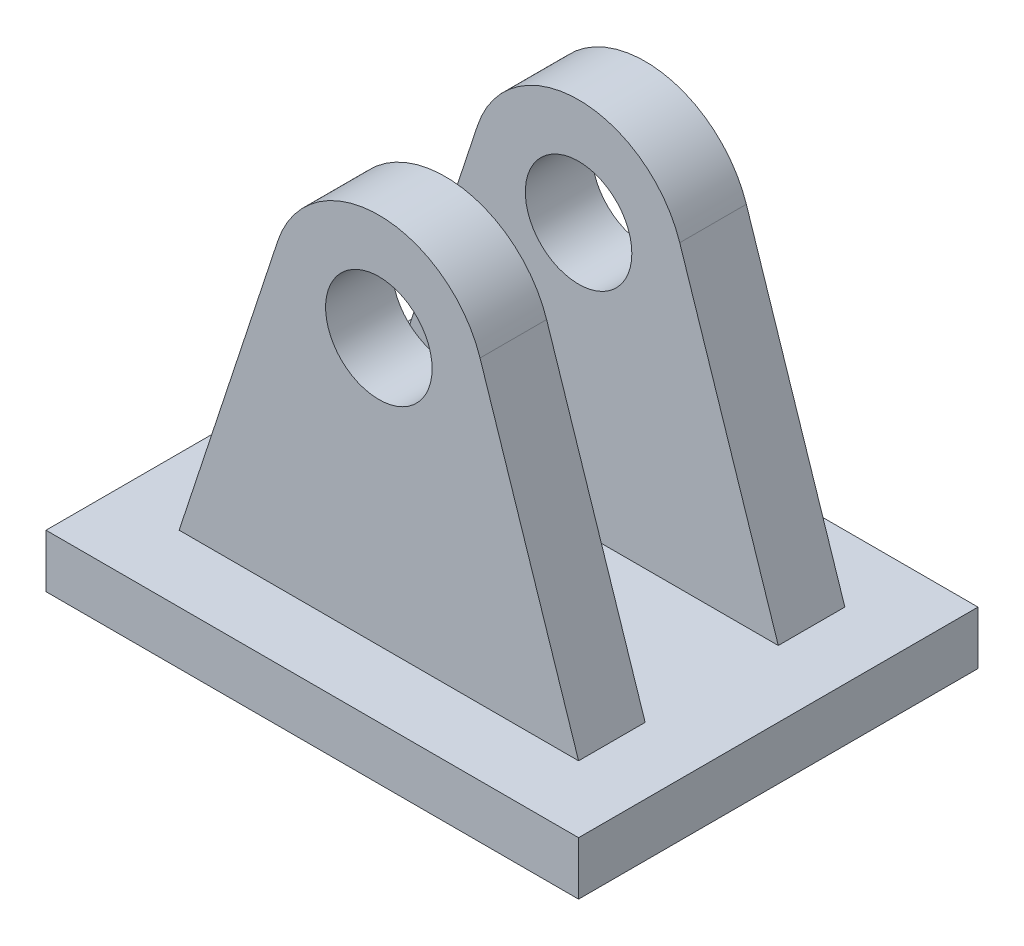
ISO-10303-21;
HEADER;
FILE_DESCRIPTION(('STEP AP214'),'2;1');
FILE_NAME('part.step','',(''),(''),'','','');
FILE_SCHEMA(('AUTOMOTIVE_DESIGN { 1 0 10303 214 1 1 1 1 }'));
ENDSEC;
DATA;
#1=APPLICATION_CONTEXT('core data for automotive mechanical design processes');
#2=APPLICATION_PROTOCOL_DEFINITION('international standard','automotive_design',2000,#1);
#3=PRODUCT_CONTEXT('',#1,'mechanical');
#4=PRODUCT('Part','Part','',(#3));
#5=PRODUCT_RELATED_PRODUCT_CATEGORY('part','',(#4));
#6=PRODUCT_DEFINITION_FORMATION('','',#4);
#7=PRODUCT_DEFINITION_CONTEXT('part definition',#1,'design');
#8=PRODUCT_DEFINITION('design','',#6,#7);
#9=PRODUCT_DEFINITION_SHAPE('','',#8);
#10=(LENGTH_UNIT() NAMED_UNIT(*) SI_UNIT(.MILLI.,.METRE.));
#11=(NAMED_UNIT(*) PLANE_ANGLE_UNIT() SI_UNIT($,.RADIAN.));
#12=(NAMED_UNIT(*) SI_UNIT($,.STERADIAN.) SOLID_ANGLE_UNIT());
#13=UNCERTAINTY_MEASURE_WITH_UNIT(LENGTH_MEASURE(1.E-05),#10,'distance_accuracy_value','');
#14=(GEOMETRIC_REPRESENTATION_CONTEXT(3) GLOBAL_UNCERTAINTY_ASSIGNED_CONTEXT((#13)) GLOBAL_UNIT_ASSIGNED_CONTEXT((#10,
#11,#12)) REPRESENTATION_CONTEXT('',''));
#15=CARTESIAN_POINT('',(0.,0.,0.));
#16=DIRECTION('',(0.,0.,1.));
#17=DIRECTION('',(1.,0.,0.));
#18=AXIS2_PLACEMENT_3D('',#15,#16,#17);
#19=CARTESIAN_POINT('',(0.,120.,50.));
#20=DIRECTION('',(0.,0.,-1.));
#21=DIRECTION('',(-1.,0.,0.));
#22=AXIS2_PLACEMENT_3D('',#19,#20,#21);
#23=CYLINDRICAL_SURFACE('',#22,40.);
#24=CARTESIAN_POINT('',(0.,120.,-25.));
#25=DIRECTION('',(0.,0.,1.));
#26=DIRECTION('',(1.,0.,0.));
#27=AXIS2_PLACEMENT_3D('',#24,#25,#26);
#28=CIRCLE('',#27,40.);
#29=CARTESIAN_POINT('',(37.9973613627572,132.498021022068,-25.));
#30=VERTEX_POINT('',#29);
#31=CARTESIAN_POINT('',(-37.9973613627572,132.498021022068,-25.));
#32=VERTEX_POINT('',#31);
#33=EDGE_CURVE('E129',#30,#32,#28,.T.);
#34=ORIENTED_EDGE('',*,*,#33,.F.);
#35=DIRECTION('',(0.,0.,-1.));
#36=VECTOR('',#35,1.);
#37=CARTESIAN_POINT('',(37.9973613627572,132.498021022068,50.));
#38=LINE('',#37,#36);
#39=CARTESIAN_POINT('',(37.9973613627572,132.498021022068,-50.));
#40=VERTEX_POINT('',#39);
#41=EDGE_CURVE('E239',#30,#40,#38,.T.);
#42=ORIENTED_EDGE('',*,*,#41,.T.);
#43=CARTESIAN_POINT('',(0.,120.,-50.));
#44=DIRECTION('',(0.,0.,1.));
#45=DIRECTION('',(1.,0.,0.));
#46=AXIS2_PLACEMENT_3D('',#43,#44,#45);
#47=CIRCLE('',#46,40.);
#48=CARTESIAN_POINT('',(-37.9973613627572,132.498021022068,-50.));
#49=VERTEX_POINT('',#48);
#50=EDGE_CURVE('E149',#40,#49,#47,.T.);
#51=ORIENTED_EDGE('',*,*,#50,.T.);
#52=DIRECTION('',(0.,0.,-1.));
#53=VECTOR('',#52,1.);
#54=CARTESIAN_POINT('',(-37.9973613627572,132.498021022068,50.));
#55=LINE('',#54,#53);
#56=EDGE_CURVE('E143',#32,#49,#55,.T.);
#57=ORIENTED_EDGE('',*,*,#56,.F.);
#58=EDGE_LOOP('',(#34,#42,#51,#57));
#59=FACE_BOUND('',#58,.T.);
#60=ADVANCED_FACE('F37',(#59),#23,.T.);
#61=CARTESIAN_POINT('',(-37.9973613627572,132.498021022068,50.));
#62=DIRECTION('',(0.949934034068929,-0.312450525551696,0.));
#63=DIRECTION('',(0.312450525551696,0.949934034068929,0.));
#64=AXIS2_PLACEMENT_3D('',#61,#62,#63);
#65=PLANE('',#64);
#66=DIRECTION('',(-0.312450525551696,-0.949934034068929,0.));
#67=VECTOR('',#66,1.);
#68=CARTESIAN_POINT('',(-37.9973613627572,132.498021022068,-25.));
#69=LINE('',#68,#67);
#70=CARTESIAN_POINT('',(-75.,20.,-25.));
#71=VERTEX_POINT('',#70);
#72=EDGE_CURVE('E132',#32,#71,#69,.T.);
#73=ORIENTED_EDGE('',*,*,#72,.F.);
#74=ORIENTED_EDGE('',*,*,#56,.T.);
#75=DIRECTION('',(-0.312450525551696,-0.949934034068929,0.));
#76=VECTOR('',#75,1.);
#77=CARTESIAN_POINT('',(-37.9973613627572,132.498021022068,-50.));
#78=LINE('',#77,#76);
#79=CARTESIAN_POINT('',(-75.,20.,-50.));
#80=VERTEX_POINT('',#79);
#81=EDGE_CURVE('E266',#49,#80,#78,.T.);
#82=ORIENTED_EDGE('',*,*,#81,.T.);
#83=DIRECTION('',(0.,0.,-1.));
#84=VECTOR('',#83,1.);
#85=CARTESIAN_POINT('',(-75.,20.,50.));
#86=LINE('',#85,#84);
#87=EDGE_CURVE('E61',#71,#80,#86,.T.);
#88=ORIENTED_EDGE('',*,*,#87,.F.);
#89=EDGE_LOOP('',(#73,#74,#82,#88));
#90=FACE_BOUND('',#89,.T.);
#91=ADVANCED_FACE('F141',(#90),#65,.F.);
#92=CARTESIAN_POINT('',(37.9973613627572,132.498021022068,50.));
#93=DIRECTION('',(-0.949934034068929,-0.312450525551696,0.));
#94=DIRECTION('',(0.312450525551696,-0.949934034068929,0.));
#95=AXIS2_PLACEMENT_3D('',#92,#93,#94);
#96=PLANE('',#95);
#97=DIRECTION('',(-0.312450525551696,0.949934034068929,0.));
#98=VECTOR('',#97,1.);
#99=CARTESIAN_POINT('',(75.,20.,-25.));
#100=LINE('',#99,#98);
#101=CARTESIAN_POINT('',(75.,20.,-25.));
#102=VERTEX_POINT('',#101);
#103=EDGE_CURVE('E134',#102,#30,#100,.T.);
#104=ORIENTED_EDGE('',*,*,#103,.F.);
#105=DIRECTION('',(0.,0.,-1.));
#106=VECTOR('',#105,1.);
#107=CARTESIAN_POINT('',(75.,20.,50.));
#108=LINE('',#107,#106);
#109=CARTESIAN_POINT('',(75.,20.,-50.));
#110=VERTEX_POINT('',#109);
#111=EDGE_CURVE('E238',#102,#110,#108,.T.);
#112=ORIENTED_EDGE('',*,*,#111,.T.);
#113=DIRECTION('',(-0.312450525551696,0.949934034068929,0.));
#114=VECTOR('',#113,1.);
#115=CARTESIAN_POINT('',(37.9973613627572,132.498021022068,-50.));
#116=LINE('',#115,#114);
#117=EDGE_CURVE('E244',#110,#40,#116,.T.);
#118=ORIENTED_EDGE('',*,*,#117,.T.);
#119=ORIENTED_EDGE('',*,*,#41,.F.);
#120=EDGE_LOOP('',(#104,#112,#118,#119));
#121=FACE_BOUND('',#120,.T.);
#122=ADVANCED_FACE('F210',(#121),#96,.F.);
#123=CARTESIAN_POINT('',(100.,20.,75.));
#124=DIRECTION('',(-1.,0.,0.));
#125=DIRECTION('',(0.,0.,1.));
#126=AXIS2_PLACEMENT_3D('',#123,#124,#125);
#127=PLANE('',#126);
#128=DIRECTION('',(0.,0.,-1.));
#129=VECTOR('',#128,1.);
#130=CARTESIAN_POINT('',(100.,0.,75.));
#131=LINE('',#130,#129);
#132=CARTESIAN_POINT('',(100.,0.,75.));
#133=VERTEX_POINT('',#132);
#134=CARTESIAN_POINT('',(100.,0.,-75.));
#135=VERTEX_POINT('',#134);
#136=EDGE_CURVE('E154',#133,#135,#131,.T.);
#137=ORIENTED_EDGE('',*,*,#136,.T.);
#138=DIRECTION('',(0.,-1.,0.));
#139=VECTOR('',#138,1.);
#140=CARTESIAN_POINT('',(100.,20.,-75.));
#141=LINE('',#140,#139);
#142=CARTESIAN_POINT('',(100.,20.,-75.));
#143=VERTEX_POINT('',#142);
#144=EDGE_CURVE('E11',#143,#135,#141,.T.);
#145=ORIENTED_EDGE('',*,*,#144,.F.);
#146=DIRECTION('',(0.,0.,-1.));
#147=VECTOR('',#146,1.);
#148=CARTESIAN_POINT('',(100.,20.,75.));
#149=LINE('',#148,#147);
#150=CARTESIAN_POINT('',(100.,20.,75.));
#151=VERTEX_POINT('',#150);
#152=EDGE_CURVE('E159',#151,#143,#149,.T.);
#153=ORIENTED_EDGE('',*,*,#152,.F.);
#154=DIRECTION('',(0.,-1.,0.));
#155=VECTOR('',#154,1.);
#156=CARTESIAN_POINT('',(100.,20.,75.));
#157=LINE('',#156,#155);
#158=EDGE_CURVE('E169',#151,#133,#157,.T.);
#159=ORIENTED_EDGE('',*,*,#158,.T.);
#160=EDGE_LOOP('',(#137,#145,#153,#159));
#161=FACE_BOUND('',#160,.T.);
#162=ADVANCED_FACE('F39',(#161),#127,.F.);
#163=CARTESIAN_POINT('',(-100.,20.,-75.));
#164=DIRECTION('',(0.,0.,1.));
#165=DIRECTION('',(1.,0.,0.));
#166=AXIS2_PLACEMENT_3D('',#163,#164,#165);
#167=PLANE('',#166);
#168=DIRECTION('',(-1.,0.,0.));
#169=VECTOR('',#168,1.);
#170=CARTESIAN_POINT('',(-100.,0.,-75.));
#171=LINE('',#170,#169);
#172=CARTESIAN_POINT('',(-100.,0.,-75.));
#173=VERTEX_POINT('',#172);
#174=EDGE_CURVE('E172',#135,#173,#171,.T.);
#175=ORIENTED_EDGE('',*,*,#174,.T.);
#176=DIRECTION('',(0.,-1.,0.));
#177=VECTOR('',#176,1.);
#178=CARTESIAN_POINT('',(-100.,20.,-75.));
#179=LINE('',#178,#177);
#180=CARTESIAN_POINT('',(-100.,20.,-75.));
#181=VERTEX_POINT('',#180);
#182=EDGE_CURVE('E46',#181,#173,#179,.T.);
#183=ORIENTED_EDGE('',*,*,#182,.F.);
#184=DIRECTION('',(-1.,0.,0.));
#185=VECTOR('',#184,1.);
#186=CARTESIAN_POINT('',(-100.,20.,-75.));
#187=LINE('',#186,#185);
#188=EDGE_CURVE('E162',#143,#181,#187,.T.);
#189=ORIENTED_EDGE('',*,*,#188,.F.);
#190=ORIENTED_EDGE('',*,*,#144,.T.);
#191=EDGE_LOOP('',(#175,#183,#189,#190));
#192=FACE_BOUND('',#191,.T.);
#193=ADVANCED_FACE('F203',(#192),#167,.F.);
#194=CARTESIAN_POINT('',(-100.,20.,75.));
#195=DIRECTION('',(1.,0.,0.));
#196=DIRECTION('',(0.,0.,-1.));
#197=AXIS2_PLACEMENT_3D('',#194,#195,#196);
#198=PLANE('',#197);
#199=DIRECTION('',(0.,0.,1.));
#200=VECTOR('',#199,1.);
#201=CARTESIAN_POINT('',(-100.,0.,75.));
#202=LINE('',#201,#200);
#203=CARTESIAN_POINT('',(-100.,0.,75.));
#204=VERTEX_POINT('',#203);
#205=EDGE_CURVE('E174',#173,#204,#202,.T.);
#206=ORIENTED_EDGE('',*,*,#205,.T.);
#207=DIRECTION('',(0.,-1.,0.));
#208=VECTOR('',#207,1.);
#209=CARTESIAN_POINT('',(-100.,20.,75.));
#210=LINE('',#209,#208);
#211=CARTESIAN_POINT('',(-100.,20.,75.));
#212=VERTEX_POINT('',#211);
#213=EDGE_CURVE('E179',#212,#204,#210,.T.);
#214=ORIENTED_EDGE('',*,*,#213,.F.);
#215=DIRECTION('',(0.,0.,1.));
#216=VECTOR('',#215,1.);
#217=CARTESIAN_POINT('',(-100.,20.,75.));
#218=LINE('',#217,#216);
#219=EDGE_CURVE('E165',#181,#212,#218,.T.);
#220=ORIENTED_EDGE('',*,*,#219,.F.);
#221=ORIENTED_EDGE('',*,*,#182,.T.);
#222=EDGE_LOOP('',(#206,#214,#220,#221));
#223=FACE_BOUND('',#222,.T.);
#224=ADVANCED_FACE('F187',(#223),#198,.F.);
#225=CARTESIAN_POINT('',(-100.,20.,75.));
#226=DIRECTION('',(0.,0.,-1.));
#227=DIRECTION('',(-1.,0.,0.));
#228=AXIS2_PLACEMENT_3D('',#225,#226,#227);
#229=PLANE('',#228);
#230=DIRECTION('',(1.,0.,0.));
#231=VECTOR('',#230,1.);
#232=CARTESIAN_POINT('',(-100.,0.,75.));
#233=LINE('',#232,#231);
#234=EDGE_CURVE('E163',#204,#133,#233,.T.);
#235=ORIENTED_EDGE('',*,*,#234,.T.);
#236=ORIENTED_EDGE('',*,*,#158,.F.);
#237=DIRECTION('',(1.,0.,0.));
#238=VECTOR('',#237,1.);
#239=CARTESIAN_POINT('',(-100.,20.,75.));
#240=LINE('',#239,#238);
#241=EDGE_CURVE('E167',#212,#151,#240,.T.);
#242=ORIENTED_EDGE('',*,*,#241,.F.);
#243=ORIENTED_EDGE('',*,*,#213,.T.);
#244=EDGE_LOOP('',(#235,#236,#242,#243));
#245=FACE_BOUND('',#244,.T.);
#246=ADVANCED_FACE('F196',(#245),#229,.F.);
#247=CARTESIAN_POINT('',(0.,20.,0.));
#248=DIRECTION('',(0.,-1.,0.));
#249=DIRECTION('',(0.,0.,-1.));
#250=AXIS2_PLACEMENT_3D('',#247,#248,#249);
#251=PLANE('',#250);
#252=CARTESIAN_POINT('',(-75.,20.,50.));
#253=VERTEX_POINT('',#252);
#254=CARTESIAN_POINT('',(-75.,20.,25.));
#255=VERTEX_POINT('',#254);
#256=EDGE_CURVE('E151',#253,#255,#86,.T.);
#257=ORIENTED_EDGE('',*,*,#256,.T.);
#258=DIRECTION('',(1.,0.,0.));
#259=VECTOR('',#258,1.);
#260=CARTESIAN_POINT('',(-75.,20.,25.));
#261=LINE('',#260,#259);
#262=CARTESIAN_POINT('',(75.,20.,25.));
#263=VERTEX_POINT('',#262);
#264=EDGE_CURVE('E251',#255,#263,#261,.T.);
#265=ORIENTED_EDGE('',*,*,#264,.T.);
#266=CARTESIAN_POINT('',(75.,20.,50.));
#267=VERTEX_POINT('',#266);
#268=EDGE_CURVE('E241',#267,#263,#108,.T.);
#269=ORIENTED_EDGE('',*,*,#268,.F.);
#270=DIRECTION('',(1.,0.,0.));
#271=VECTOR('',#270,1.);
#272=CARTESIAN_POINT('',(-75.,20.,50.));
#273=LINE('',#272,#271);
#274=EDGE_CURVE('E250',#253,#267,#273,.T.);
#275=ORIENTED_EDGE('',*,*,#274,.F.);
#276=EDGE_LOOP('',(#257,#265,#269,#275));
#277=FACE_BOUND('',#276,.T.);
#278=DIRECTION('',(1.,0.,0.));
#279=VECTOR('',#278,1.);
#280=CARTESIAN_POINT('',(-75.,20.,-25.));
#281=LINE('',#280,#279);
#282=EDGE_CURVE('E145',#71,#102,#281,.T.);
#283=ORIENTED_EDGE('',*,*,#282,.F.);
#284=ORIENTED_EDGE('',*,*,#87,.T.);
#285=DIRECTION('',(1.,0.,0.));
#286=VECTOR('',#285,1.);
#287=CARTESIAN_POINT('',(-75.,20.,-50.));
#288=LINE('',#287,#286);
#289=EDGE_CURVE('E267',#80,#110,#288,.T.);
#290=ORIENTED_EDGE('',*,*,#289,.T.);
#291=ORIENTED_EDGE('',*,*,#111,.F.);
#292=EDGE_LOOP('',(#283,#284,#290,#291));
#293=FACE_BOUND('',#292,.T.);
#294=ORIENTED_EDGE('',*,*,#152,.T.);
#295=ORIENTED_EDGE('',*,*,#188,.T.);
#296=ORIENTED_EDGE('',*,*,#219,.T.);
#297=ORIENTED_EDGE('',*,*,#241,.T.);
#298=EDGE_LOOP('',(#294,#295,#296,#297));
#299=FACE_BOUND('',#298,.T.);
#300=ADVANCED_FACE('F202',(#277,#293,#299),#251,.F.);
#301=CARTESIAN_POINT('',(0.,0.,0.));
#302=DIRECTION('',(0.,-1.,0.));
#303=DIRECTION('',(0.,0.,-1.));
#304=AXIS2_PLACEMENT_3D('',#301,#302,#303);
#305=PLANE('',#304);
#306=ORIENTED_EDGE('',*,*,#136,.F.);
#307=ORIENTED_EDGE('',*,*,#234,.F.);
#308=ORIENTED_EDGE('',*,*,#205,.F.);
#309=ORIENTED_EDGE('',*,*,#174,.F.);
#310=EDGE_LOOP('',(#306,#307,#308,#309));
#311=FACE_BOUND('',#310,.T.);
#312=ADVANCED_FACE('F193',(#311),#305,.T.);
#313=CARTESIAN_POINT('',(37.9973613627572,132.498021022068,50.));
#314=VERTEX_POINT('',#313);
#315=CARTESIAN_POINT('',(37.9973613627572,132.498021022068,25.));
#316=VERTEX_POINT('',#315);
#317=EDGE_CURVE('E232',#314,#316,#38,.T.);
#318=ORIENTED_EDGE('',*,*,#317,.T.);
#319=CARTESIAN_POINT('',(0.,120.,25.));
#320=DIRECTION('',(0.,0.,1.));
#321=DIRECTION('',(1.,0.,0.));
#322=AXIS2_PLACEMENT_3D('',#319,#320,#321);
#323=CIRCLE('',#322,40.);
#324=CARTESIAN_POINT('',(-37.9973613627572,132.498021022068,25.));
#325=VERTEX_POINT('',#324);
#326=EDGE_CURVE('E53',#316,#325,#323,.T.);
#327=ORIENTED_EDGE('',*,*,#326,.T.);
#328=CARTESIAN_POINT('',(-37.9973613627572,132.498021022068,50.));
#329=VERTEX_POINT('',#328);
#330=EDGE_CURVE('E150',#329,#325,#55,.T.);
#331=ORIENTED_EDGE('',*,*,#330,.F.);
#332=CARTESIAN_POINT('',(0.,120.,50.));
#333=DIRECTION('',(0.,0.,1.));
#334=DIRECTION('',(1.,0.,0.));
#335=AXIS2_PLACEMENT_3D('',#332,#333,#334);
#336=CIRCLE('',#335,40.);
#337=EDGE_CURVE('E235',#314,#329,#336,.T.);
#338=ORIENTED_EDGE('',*,*,#337,.F.);
#339=EDGE_LOOP('',(#318,#327,#331,#338));
#340=FACE_BOUND('',#339,.T.);
#341=ADVANCED_FACE('F213',(#340),#23,.T.);
#342=ORIENTED_EDGE('',*,*,#330,.T.);
#343=DIRECTION('',(-0.312450525551696,-0.949934034068929,0.));
#344=VECTOR('',#343,1.);
#345=CARTESIAN_POINT('',(-37.9973613627572,132.498021022068,25.));
#346=LINE('',#345,#344);
#347=EDGE_CURVE('E254',#325,#255,#346,.T.);
#348=ORIENTED_EDGE('',*,*,#347,.T.);
#349=ORIENTED_EDGE('',*,*,#256,.F.);
#350=DIRECTION('',(-0.312450525551696,-0.949934034068929,0.));
#351=VECTOR('',#350,1.);
#352=CARTESIAN_POINT('',(-37.9973613627572,132.498021022068,50.));
#353=LINE('',#352,#351);
#354=EDGE_CURVE('E261',#329,#253,#353,.T.);
#355=ORIENTED_EDGE('',*,*,#354,.F.);
#356=EDGE_LOOP('',(#342,#348,#349,#355));
#357=FACE_BOUND('',#356,.T.);
#358=ADVANCED_FACE('F218',(#357),#65,.F.);
#359=ORIENTED_EDGE('',*,*,#268,.T.);
#360=DIRECTION('',(-0.312450525551696,0.949934034068929,0.));
#361=VECTOR('',#360,1.);
#362=CARTESIAN_POINT('',(75.,20.,25.));
#363=LINE('',#362,#361);
#364=EDGE_CURVE('E138',#263,#316,#363,.T.);
#365=ORIENTED_EDGE('',*,*,#364,.T.);
#366=ORIENTED_EDGE('',*,*,#317,.F.);
#367=DIRECTION('',(-0.312450525551696,0.949934034068929,0.));
#368=VECTOR('',#367,1.);
#369=CARTESIAN_POINT('',(37.9973613627572,132.498021022068,50.));
#370=LINE('',#369,#368);
#371=EDGE_CURVE('E242',#267,#314,#370,.T.);
#372=ORIENTED_EDGE('',*,*,#371,.F.);
#373=EDGE_LOOP('',(#359,#365,#366,#372));
#374=FACE_BOUND('',#373,.T.);
#375=ADVANCED_FACE('F226',(#374),#96,.F.);
#376=CARTESIAN_POINT('',(0.,120.,50.));
#377=DIRECTION('',(0.,0.,1.));
#378=DIRECTION('',(1.,0.,0.));
#379=AXIS2_PLACEMENT_3D('',#376,#377,#378);
#380=PLANE('',#379);
#381=CARTESIAN_POINT('',(0.,120.,50.));
#382=DIRECTION('',(0.,0.,1.));
#383=DIRECTION('',(1.,0.,0.));
#384=AXIS2_PLACEMENT_3D('',#381,#382,#383);
#385=CIRCLE('',#384,20.);
#386=CARTESIAN_POINT('',(20.,120.,50.));
#387=VERTEX_POINT('',#386);
#388=EDGE_CURVE('E446',#387,#387,#385,.T.);
#389=ORIENTED_EDGE('',*,*,#388,.F.);
#390=EDGE_LOOP('',(#389));
#391=FACE_BOUND('',#390,.T.);
#392=ORIENTED_EDGE('',*,*,#337,.T.);
#393=ORIENTED_EDGE('',*,*,#354,.T.);
#394=ORIENTED_EDGE('',*,*,#274,.T.);
#395=ORIENTED_EDGE('',*,*,#371,.T.);
#396=EDGE_LOOP('',(#392,#393,#394,#395));
#397=FACE_BOUND('',#396,.T.);
#398=ADVANCED_FACE('F275',(#391,#397),#380,.T.);
#399=CARTESIAN_POINT('',(0.,120.,-50.));
#400=DIRECTION('',(0.,0.,1.));
#401=DIRECTION('',(1.,0.,0.));
#402=AXIS2_PLACEMENT_3D('',#399,#400,#401);
#403=PLANE('',#402);
#404=CARTESIAN_POINT('',(0.,120.,-50.));
#405=DIRECTION('',(0.,0.,1.));
#406=DIRECTION('',(1.,0.,0.));
#407=AXIS2_PLACEMENT_3D('',#404,#405,#406);
#408=CIRCLE('',#407,20.);
#409=CARTESIAN_POINT('',(20.,120.,-50.));
#410=VERTEX_POINT('',#409);
#411=EDGE_CURVE('E438',#410,#410,#408,.T.);
#412=ORIENTED_EDGE('',*,*,#411,.T.);
#413=EDGE_LOOP('',(#412));
#414=FACE_BOUND('',#413,.T.);
#415=ORIENTED_EDGE('',*,*,#50,.F.);
#416=ORIENTED_EDGE('',*,*,#117,.F.);
#417=ORIENTED_EDGE('',*,*,#289,.F.);
#418=ORIENTED_EDGE('',*,*,#81,.F.);
#419=EDGE_LOOP('',(#415,#416,#417,#418));
#420=FACE_BOUND('',#419,.T.);
#421=ADVANCED_FACE('F273',(#414,#420),#403,.F.);
#422=CARTESIAN_POINT('',(0.,120.,-25.));
#423=DIRECTION('',(0.,0.,1.));
#424=DIRECTION('',(1.,0.,0.));
#425=AXIS2_PLACEMENT_3D('',#422,#423,#424);
#426=PLANE('',#425);
#427=CARTESIAN_POINT('',(0.,120.,-25.));
#428=DIRECTION('',(0.,0.,1.));
#429=DIRECTION('',(1.,0.,0.));
#430=AXIS2_PLACEMENT_3D('',#427,#428,#429);
#431=CIRCLE('',#430,20.);
#432=CARTESIAN_POINT('',(20.,120.,-25.));
#433=VERTEX_POINT('',#432);
#434=EDGE_CURVE('E436',#433,#433,#431,.T.);
#435=ORIENTED_EDGE('',*,*,#434,.F.);
#436=EDGE_LOOP('',(#435));
#437=FACE_BOUND('',#436,.T.);
#438=ORIENTED_EDGE('',*,*,#33,.T.);
#439=ORIENTED_EDGE('',*,*,#72,.T.);
#440=ORIENTED_EDGE('',*,*,#282,.T.);
#441=ORIENTED_EDGE('',*,*,#103,.T.);
#442=EDGE_LOOP('',(#438,#439,#440,#441));
#443=FACE_BOUND('',#442,.T.);
#444=ADVANCED_FACE('F131',(#437,#443),#426,.T.);
#445=CARTESIAN_POINT('',(0.,120.,25.));
#446=DIRECTION('',(0.,0.,1.));
#447=DIRECTION('',(1.,0.,0.));
#448=AXIS2_PLACEMENT_3D('',#445,#446,#447);
#449=PLANE('',#448);
#450=CARTESIAN_POINT('',(0.,120.,25.));
#451=DIRECTION('',(0.,0.,1.));
#452=DIRECTION('',(1.,0.,0.));
#453=AXIS2_PLACEMENT_3D('',#450,#451,#452);
#454=CIRCLE('',#453,20.);
#455=CARTESIAN_POINT('',(20.,120.,25.));
#456=VERTEX_POINT('',#455);
#457=EDGE_CURVE('E41',#456,#456,#454,.T.);
#458=ORIENTED_EDGE('',*,*,#457,.T.);
#459=EDGE_LOOP('',(#458));
#460=FACE_BOUND('',#459,.T.);
#461=ORIENTED_EDGE('',*,*,#326,.F.);
#462=ORIENTED_EDGE('',*,*,#364,.F.);
#463=ORIENTED_EDGE('',*,*,#264,.F.);
#464=ORIENTED_EDGE('',*,*,#347,.F.);
#465=EDGE_LOOP('',(#461,#462,#463,#464));
#466=FACE_BOUND('',#465,.T.);
#467=ADVANCED_FACE('F256',(#460,#466),#449,.F.);
#468=CARTESIAN_POINT('',(0.,120.,-75.));
#469=DIRECTION('',(0.,0.,1.));
#470=DIRECTION('',(1.,0.,0.));
#471=AXIS2_PLACEMENT_3D('',#468,#469,#470);
#472=CYLINDRICAL_SURFACE('',#471,20.);
#473=ORIENTED_EDGE('',*,*,#388,.T.);
#474=EDGE_LOOP('',(#473));
#475=FACE_BOUND('',#474,.T.);
#476=ORIENTED_EDGE('',*,*,#457,.F.);
#477=EDGE_LOOP('',(#476));
#478=FACE_BOUND('',#477,.T.);
#479=ADVANCED_FACE('F406',(#475,#478),#472,.F.);
#480=ORIENTED_EDGE('',*,*,#434,.T.);
#481=EDGE_LOOP('',(#480));
#482=FACE_BOUND('',#481,.T.);
#483=ORIENTED_EDGE('',*,*,#411,.F.);
#484=EDGE_LOOP('',(#483));
#485=FACE_BOUND('',#484,.T.);
#486=ADVANCED_FACE('F416',(#482,#485),#472,.F.);
#487=CLOSED_SHELL('',(#60,#91,#122,#162,#193,#224,#246,#300,#312,#341,#358,#375,#398,#421,#444,
#467,#479,#486));
#488=MANIFOLD_SOLID_BREP('B2',#487);
#489=ADVANCED_BREP_SHAPE_REPRESENTATION('',(#18,#488),#14);
#490=SHAPE_DEFINITION_REPRESENTATION(#9,#489);
ENDSEC;
END-ISO-10303-21;
